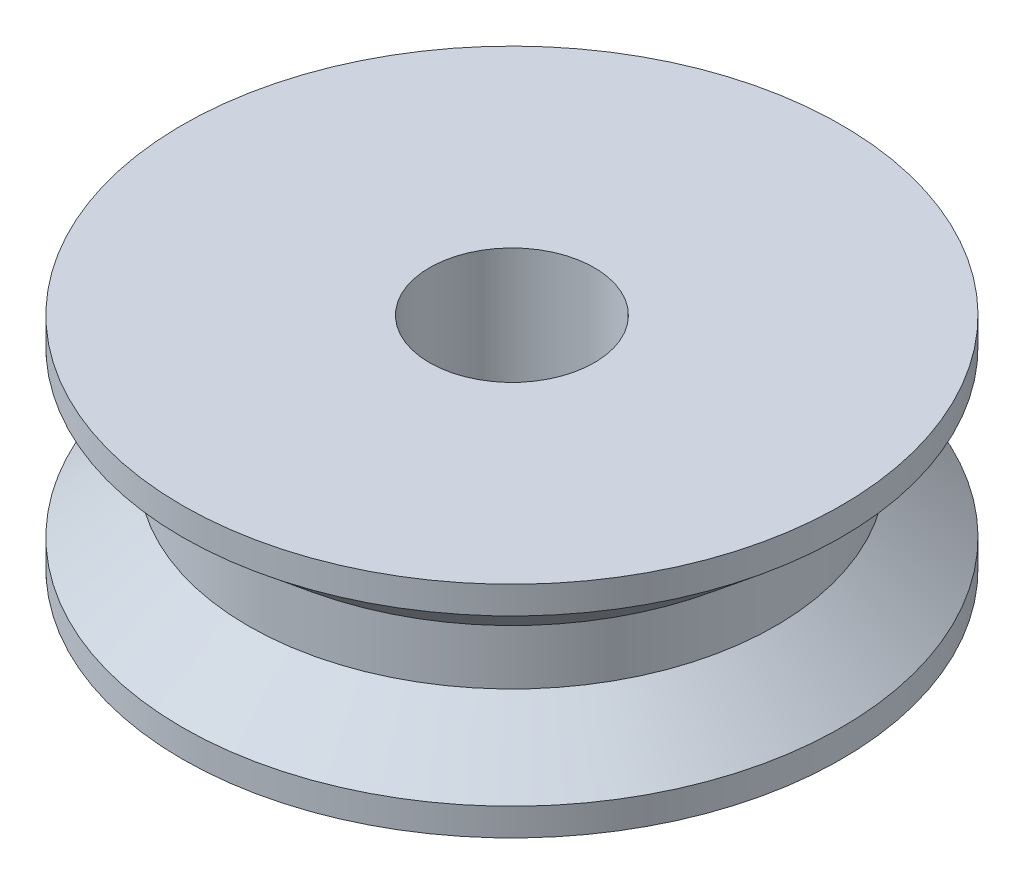
ISO-10303-21;
HEADER;
FILE_DESCRIPTION(('STEP AP214'),'2;1');
FILE_NAME('part.step','',(''),(''),'','','');
FILE_SCHEMA(('AUTOMOTIVE_DESIGN { 1 0 10303 214 1 1 1 1 }'));
ENDSEC;
DATA;
#1=APPLICATION_CONTEXT('core data for automotive mechanical design processes');
#2=APPLICATION_PROTOCOL_DEFINITION('international standard','automotive_design',2000,#1);
#3=PRODUCT_CONTEXT('',#1,'mechanical');
#4=PRODUCT('Part','Part','',(#3));
#5=PRODUCT_RELATED_PRODUCT_CATEGORY('part','',(#4));
#6=PRODUCT_DEFINITION_FORMATION('','',#4);
#7=PRODUCT_DEFINITION_CONTEXT('part definition',#1,'design');
#8=PRODUCT_DEFINITION('design','',#6,#7);
#9=PRODUCT_DEFINITION_SHAPE('','',#8);
#10=(LENGTH_UNIT() NAMED_UNIT(*) SI_UNIT(.MILLI.,.METRE.));
#11=(NAMED_UNIT(*) PLANE_ANGLE_UNIT() SI_UNIT($,.RADIAN.));
#12=(NAMED_UNIT(*) SI_UNIT($,.STERADIAN.) SOLID_ANGLE_UNIT());
#13=UNCERTAINTY_MEASURE_WITH_UNIT(LENGTH_MEASURE(1.E-05),#10,'distance_accuracy_value','');
#14=(GEOMETRIC_REPRESENTATION_CONTEXT(3) GLOBAL_UNCERTAINTY_ASSIGNED_CONTEXT((#13)) GLOBAL_UNIT_ASSIGNED_CONTEXT((#10,
#11,#12)) REPRESENTATION_CONTEXT('',''));
#15=CARTESIAN_POINT('',(0.,0.,0.));
#16=DIRECTION('',(0.,0.,1.));
#17=DIRECTION('',(1.,0.,0.));
#18=AXIS2_PLACEMENT_3D('',#15,#16,#17);
#19=CARTESIAN_POINT('',(0.,4.,0.));
#20=DIRECTION('',(0.,-1.,0.));
#21=DIRECTION('',(0.,0.,-1.));
#22=AXIS2_PLACEMENT_3D('',#19,#20,#21);
#23=CYLINDRICAL_SURFACE('',#22,6.);
#24=CARTESIAN_POINT('',(0.,4.,0.));
#25=DIRECTION('',(0.,1.,0.));
#26=DIRECTION('',(0.,0.,1.));
#27=AXIS2_PLACEMENT_3D('',#24,#25,#26);
#28=CIRCLE('',#27,6.);
#29=CARTESIAN_POINT('',(0.,4.,6.));
#30=VERTEX_POINT('',#29);
#31=EDGE_CURVE('E10',#30,#30,#28,.T.);
#32=ORIENTED_EDGE('',*,*,#31,.F.);
#33=EDGE_LOOP('',(#32));
#34=FACE_BOUND('',#33,.T.);
#35=CARTESIAN_POINT('',(0.,3.5,0.));
#36=DIRECTION('',(0.,1.,0.));
#37=DIRECTION('',(0.,0.,1.));
#38=AXIS2_PLACEMENT_3D('',#35,#36,#37);
#39=CIRCLE('',#38,6.);
#40=CARTESIAN_POINT('',(0.,3.5,6.));
#41=VERTEX_POINT('',#40);
#42=EDGE_CURVE('E49',#41,#41,#39,.T.);
#43=ORIENTED_EDGE('',*,*,#42,.T.);
#44=EDGE_LOOP('',(#43));
#45=FACE_BOUND('',#44,.T.);
#46=ADVANCED_FACE('F34',(#34,#45),#23,.T.);
#47=CARTESIAN_POINT('',(0.,0.,0.));
#48=DIRECTION('',(0.,1.,0.));
#49=DIRECTION('',(0.,0.,1.));
#50=AXIS2_PLACEMENT_3D('',#47,#48,#49);
#51=CIRCLE('',#50,6.);
#52=CARTESIAN_POINT('',(0.,0.,6.));
#53=VERTEX_POINT('',#52);
#54=EDGE_CURVE('E37',#53,#53,#51,.T.);
#55=ORIENTED_EDGE('',*,*,#54,.T.);
#56=EDGE_LOOP('',(#55));
#57=FACE_BOUND('',#56,.T.);
#58=CARTESIAN_POINT('',(0.,0.5,0.));
#59=DIRECTION('',(0.,1.,0.));
#60=DIRECTION('',(0.,0.,1.));
#61=AXIS2_PLACEMENT_3D('',#58,#59,#60);
#62=CIRCLE('',#61,6.);
#63=CARTESIAN_POINT('',(0.,0.5,6.));
#64=VERTEX_POINT('',#63);
#65=EDGE_CURVE('E54',#64,#64,#62,.T.);
#66=ORIENTED_EDGE('',*,*,#65,.F.);
#67=EDGE_LOOP('',(#66));
#68=FACE_BOUND('',#67,.T.);
#69=ADVANCED_FACE('F78',(#57,#68),#23,.T.);
#70=CARTESIAN_POINT('',(0.,4.,0.));
#71=DIRECTION('',(0.,1.,0.));
#72=DIRECTION('',(0.,0.,1.));
#73=AXIS2_PLACEMENT_3D('',#70,#71,#72);
#74=PLANE('',#73);
#75=ORIENTED_EDGE('',*,*,#31,.T.);
#76=EDGE_LOOP('',(#75));
#77=FACE_BOUND('',#76,.T.);
#78=CARTESIAN_POINT('',(0.,4.,0.));
#79=DIRECTION('',(0.,1.,0.));
#80=DIRECTION('',(0.,0.,1.));
#81=AXIS2_PLACEMENT_3D('',#78,#79,#80);
#82=CIRCLE('',#81,1.5);
#83=CARTESIAN_POINT('',(0.,4.,1.5));
#84=VERTEX_POINT('',#83);
#85=EDGE_CURVE('E44',#84,#84,#82,.T.);
#86=ORIENTED_EDGE('',*,*,#85,.F.);
#87=EDGE_LOOP('',(#86));
#88=FACE_BOUND('',#87,.T.);
#89=ADVANCED_FACE('F83',(#77,#88),#74,.T.);
#90=CARTESIAN_POINT('',(0.,0.,0.));
#91=DIRECTION('',(0.,1.,0.));
#92=DIRECTION('',(0.,0.,1.));
#93=AXIS2_PLACEMENT_3D('',#90,#91,#92);
#94=PLANE('',#93);
#95=ORIENTED_EDGE('',*,*,#54,.F.);
#96=EDGE_LOOP('',(#95));
#97=FACE_BOUND('',#96,.T.);
#98=CARTESIAN_POINT('',(0.,0.,0.));
#99=DIRECTION('',(0.,1.,0.));
#100=DIRECTION('',(0.,0.,1.));
#101=AXIS2_PLACEMENT_3D('',#98,#99,#100);
#102=CIRCLE('',#101,1.5);
#103=CARTESIAN_POINT('',(0.,0.,1.5));
#104=VERTEX_POINT('',#103);
#105=EDGE_CURVE('E46',#104,#104,#102,.T.);
#106=ORIENTED_EDGE('',*,*,#105,.T.);
#107=EDGE_LOOP('',(#106));
#108=FACE_BOUND('',#107,.T.);
#109=ADVANCED_FACE('F93',(#97,#108),#94,.F.);
#110=CARTESIAN_POINT('',(0.,4.,0.));
#111=DIRECTION('',(0.,-1.,0.));
#112=DIRECTION('',(0.,0.,-1.));
#113=AXIS2_PLACEMENT_3D('',#110,#111,#112);
#114=CYLINDRICAL_SURFACE('',#113,1.5);
#115=ORIENTED_EDGE('',*,*,#85,.T.);
#116=EDGE_LOOP('',(#115));
#117=FACE_BOUND('',#116,.T.);
#118=ORIENTED_EDGE('',*,*,#105,.F.);
#119=EDGE_LOOP('',(#118));
#120=FACE_BOUND('',#119,.T.);
#121=ADVANCED_FACE('F88',(#117,#120),#114,.F.);
#122=CARTESIAN_POINT('',(0.,3.5,0.));
#123=DIRECTION('',(0.,1.,0.));
#124=DIRECTION('',(0.,0.,1.));
#125=AXIS2_PLACEMENT_3D('',#122,#123,#124);
#126=CONICAL_SURFACE('',#125,6.,0.876058050598193);
#127=CARTESIAN_POINT('',(0.,2.5,0.));
#128=DIRECTION('',(0.,1.,0.));
#129=DIRECTION('',(0.,0.,1.));
#130=AXIS2_PLACEMENT_3D('',#127,#128,#129);
#131=CIRCLE('',#130,4.8);
#132=CARTESIAN_POINT('',(0.,2.5,4.8));
#133=VERTEX_POINT('',#132);
#134=EDGE_CURVE('E60',#133,#133,#131,.T.);
#135=ORIENTED_EDGE('',*,*,#134,.T.);
#136=EDGE_LOOP('',(#135));
#137=FACE_BOUND('',#136,.T.);
#138=ORIENTED_EDGE('',*,*,#42,.F.);
#139=EDGE_LOOP('',(#138));
#140=FACE_BOUND('',#139,.T.);
#141=ADVANCED_FACE('F64',(#137,#140),#126,.T.);
#142=CARTESIAN_POINT('',(0.,1.5,0.));
#143=DIRECTION('',(0.,-1.,0.));
#144=DIRECTION('',(0.,0.,-1.));
#145=AXIS2_PLACEMENT_3D('',#142,#143,#144);
#146=CONICAL_SURFACE('',#145,4.8,0.876058050598193);
#147=ORIENTED_EDGE('',*,*,#65,.T.);
#148=EDGE_LOOP('',(#147));
#149=FACE_BOUND('',#148,.T.);
#150=CARTESIAN_POINT('',(0.,1.5,0.));
#151=DIRECTION('',(0.,1.,0.));
#152=DIRECTION('',(0.,0.,1.));
#153=AXIS2_PLACEMENT_3D('',#150,#151,#152);
#154=CIRCLE('',#153,4.8);
#155=CARTESIAN_POINT('',(0.,1.5,4.8));
#156=VERTEX_POINT('',#155);
#157=EDGE_CURVE('E57',#156,#156,#154,.T.);
#158=ORIENTED_EDGE('',*,*,#157,.F.);
#159=EDGE_LOOP('',(#158));
#160=FACE_BOUND('',#159,.T.);
#161=ADVANCED_FACE('F69',(#149,#160),#146,.T.);
#162=CARTESIAN_POINT('',(0.,4.,0.));
#163=DIRECTION('',(0.,1.,0.));
#164=DIRECTION('',(0.,0.,1.));
#165=AXIS2_PLACEMENT_3D('',#162,#163,#164);
#166=CYLINDRICAL_SURFACE('',#165,4.8);
#167=ORIENTED_EDGE('',*,*,#157,.T.);
#168=EDGE_LOOP('',(#167));
#169=FACE_BOUND('',#168,.T.);
#170=ORIENTED_EDGE('',*,*,#134,.F.);
#171=EDGE_LOOP('',(#170));
#172=FACE_BOUND('',#171,.T.);
#173=ADVANCED_FACE('F67',(#169,#172),#166,.T.);
#174=CLOSED_SHELL('',(#46,#69,#89,#109,#121,#141,#161,#173));
#175=MANIFOLD_SOLID_BREP('B2',#174);
#176=ADVANCED_BREP_SHAPE_REPRESENTATION('',(#18,#175),#14);
#177=SHAPE_DEFINITION_REPRESENTATION(#9,#176);
ENDSEC;
END-ISO-10303-21;
